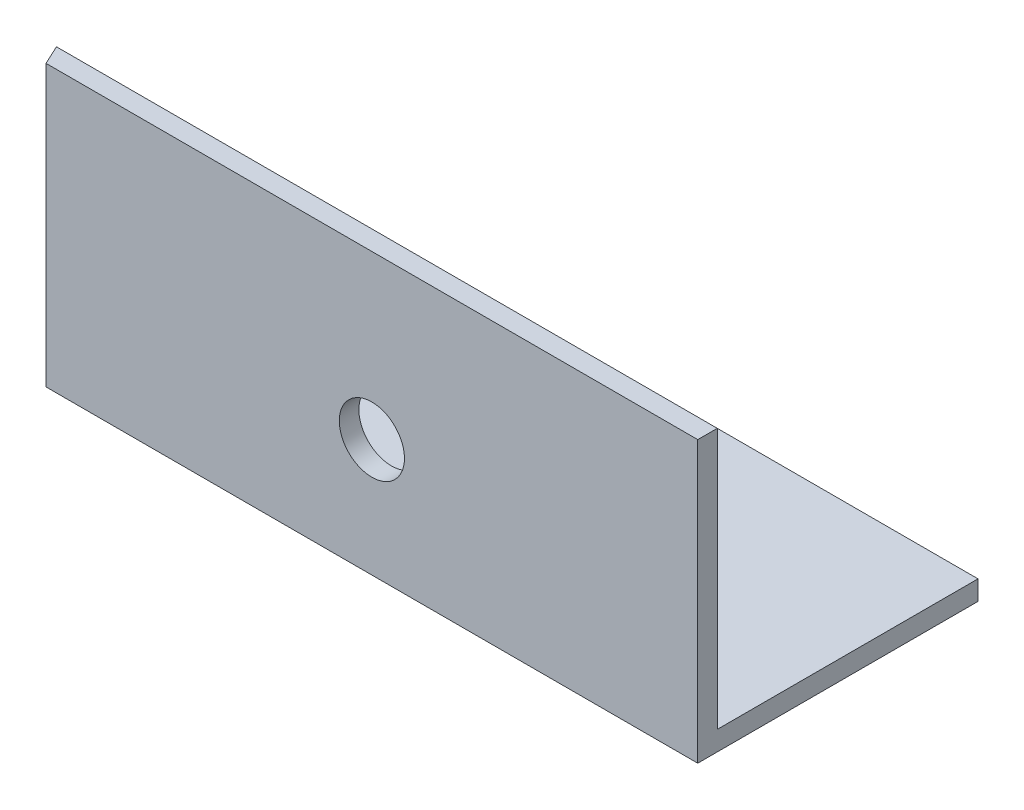
ISO-10303-21;
HEADER;
FILE_DESCRIPTION(('STEP AP214'),'2;1');
FILE_NAME('part.step','',(''),(''),'','','');
FILE_SCHEMA(('AUTOMOTIVE_DESIGN { 1 0 10303 214 1 1 1 1 }'));
ENDSEC;
DATA;
#1=APPLICATION_CONTEXT('core data for automotive mechanical design processes');
#2=APPLICATION_PROTOCOL_DEFINITION('international standard','automotive_design',2000,#1);
#3=PRODUCT_CONTEXT('',#1,'mechanical');
#4=PRODUCT('Part','Part','',(#3));
#5=PRODUCT_RELATED_PRODUCT_CATEGORY('part','',(#4));
#6=PRODUCT_DEFINITION_FORMATION('','',#4);
#7=PRODUCT_DEFINITION_CONTEXT('part definition',#1,'design');
#8=PRODUCT_DEFINITION('design','',#6,#7);
#9=PRODUCT_DEFINITION_SHAPE('','',#8);
#10=(LENGTH_UNIT() NAMED_UNIT(*) SI_UNIT(.MILLI.,.METRE.));
#11=(NAMED_UNIT(*) PLANE_ANGLE_UNIT() SI_UNIT($,.RADIAN.));
#12=(NAMED_UNIT(*) SI_UNIT($,.STERADIAN.) SOLID_ANGLE_UNIT());
#13=UNCERTAINTY_MEASURE_WITH_UNIT(LENGTH_MEASURE(1.E-05),#10,'distance_accuracy_value','');
#14=(GEOMETRIC_REPRESENTATION_CONTEXT(3) GLOBAL_UNCERTAINTY_ASSIGNED_CONTEXT((#13)) GLOBAL_UNIT_ASSIGNED_CONTEXT((#10,
#11,#12)) REPRESENTATION_CONTEXT('',''));
#15=CARTESIAN_POINT('',(0.,0.,0.));
#16=DIRECTION('',(0.,0.,1.));
#17=DIRECTION('',(1.,0.,0.));
#18=AXIS2_PLACEMENT_3D('',#15,#16,#17);
#19=CARTESIAN_POINT('',(120.,-3.,0.));
#20=DIRECTION('',(0.,1.,0.));
#21=DIRECTION('',(0.,0.,1.));
#22=AXIS2_PLACEMENT_3D('',#19,#20,#21);
#23=PLANE('',#22);
#24=DIRECTION('',(-0.421730749715584,0.,-0.906721111888507));
#25=VECTOR('',#24,1.);
#26=CARTESIAN_POINT('',(0.,-3.,-40.));
#27=LINE('',#26,#25);
#28=CARTESIAN_POINT('',(20.,-3.,3.00000000000001));
#29=VERTEX_POINT('',#28);
#30=CARTESIAN_POINT('',(0.,-3.,-40.));
#31=VERTEX_POINT('',#30);
#32=EDGE_CURVE('E79',#29,#31,#27,.T.);
#33=ORIENTED_EDGE('',*,*,#32,.T.);
#34=DIRECTION('',(-1.,0.,0.));
#35=VECTOR('',#34,1.);
#36=CARTESIAN_POINT('',(120.,-3.,-40.));
#37=LINE('',#36,#35);
#38=CARTESIAN_POINT('',(120.,-3.,-40.));
#39=VERTEX_POINT('',#38);
#40=EDGE_CURVE('E11',#39,#31,#37,.T.);
#41=ORIENTED_EDGE('',*,*,#40,.F.);
#42=DIRECTION('',(0.,0.,-1.));
#43=VECTOR('',#42,1.);
#44=CARTESIAN_POINT('',(120.,-3.,0.));
#45=LINE('',#44,#43);
#46=CARTESIAN_POINT('',(120.,-3.,3.00000000000001));
#47=VERTEX_POINT('',#46);
#48=EDGE_CURVE('E100',#47,#39,#45,.T.);
#49=ORIENTED_EDGE('',*,*,#48,.F.);
#50=DIRECTION('',(-1.,0.,0.));
#51=VECTOR('',#50,1.);
#52=CARTESIAN_POINT('',(120.,-3.,3.00000000000001));
#53=LINE('',#52,#51);
#54=EDGE_CURVE('E95',#47,#29,#53,.T.);
#55=ORIENTED_EDGE('',*,*,#54,.T.);
#56=EDGE_LOOP('',(#33,#41,#49,#55));
#57=FACE_BOUND('',#56,.T.);
#58=ADVANCED_FACE('F32',(#57),#23,.F.);
#59=CARTESIAN_POINT('',(120.,0.,0.));
#60=DIRECTION('',(0.,1.,0.));
#61=DIRECTION('',(0.,0.,1.));
#62=AXIS2_PLACEMENT_3D('',#59,#60,#61);
#63=PLANE('',#62);
#64=DIRECTION('',(-1.,0.,0.));
#65=VECTOR('',#64,1.);
#66=CARTESIAN_POINT('',(120.,0.,-40.));
#67=LINE('',#66,#65);
#68=CARTESIAN_POINT('',(120.,0.,-40.));
#69=VERTEX_POINT('',#68);
#70=CARTESIAN_POINT('',(0.,0.,-40.));
#71=VERTEX_POINT('',#70);
#72=EDGE_CURVE('E40',#69,#71,#67,.T.);
#73=ORIENTED_EDGE('',*,*,#72,.T.);
#74=DIRECTION('',(0.421730749715584,0.,0.906721111888507));
#75=VECTOR('',#74,1.);
#76=CARTESIAN_POINT('',(36.6385060026678,0.,38.7727879057359));
#77=LINE('',#76,#75);
#78=CARTESIAN_POINT('',(18.6046511627907,0.,0.));
#79=VERTEX_POINT('',#78);
#80=EDGE_CURVE('E117',#71,#79,#77,.T.);
#81=ORIENTED_EDGE('',*,*,#80,.T.);
#82=DIRECTION('',(-1.,0.,0.));
#83=VECTOR('',#82,1.);
#84=CARTESIAN_POINT('',(120.,0.,0.));
#85=LINE('',#84,#83);
#86=CARTESIAN_POINT('',(120.,0.,0.));
#87=VERTEX_POINT('',#86);
#88=EDGE_CURVE('E110',#87,#79,#85,.T.);
#89=ORIENTED_EDGE('',*,*,#88,.F.);
#90=DIRECTION('',(0.,0.,-1.));
#91=VECTOR('',#90,1.);
#92=CARTESIAN_POINT('',(120.,0.,0.));
#93=LINE('',#92,#91);
#94=EDGE_CURVE('E119',#87,#69,#93,.T.);
#95=ORIENTED_EDGE('',*,*,#94,.T.);
#96=EDGE_LOOP('',(#73,#81,#89,#95));
#97=FACE_BOUND('',#96,.T.);
#98=ADVANCED_FACE('F116',(#97),#63,.T.);
#99=CARTESIAN_POINT('',(120.,40.,-1.19525527596782E-13));
#100=DIRECTION('',(0.,0.,-1.));
#101=DIRECTION('',(0.,1.,0.));
#102=AXIS2_PLACEMENT_3D('',#99,#100,#101);
#103=PLANE('',#102);
#104=CARTESIAN_POINT('',(70.,15.,0.));
#105=DIRECTION('',(0.,0.,-1.));
#106=DIRECTION('',(0.,1.,0.));
#107=AXIS2_PLACEMENT_3D('',#104,#105,#106);
#108=CIRCLE('',#107,5.);
#109=CARTESIAN_POINT('',(70.,20.,0.));
#110=VERTEX_POINT('',#109);
#111=EDGE_CURVE('E90',#110,#110,#108,.T.);
#112=ORIENTED_EDGE('',*,*,#111,.F.);
#113=EDGE_LOOP('',(#112));
#114=FACE_BOUND('',#113,.T.);
#115=ORIENTED_EDGE('',*,*,#88,.T.);
#116=DIRECTION('',(0.,1.,0.));
#117=VECTOR('',#116,1.);
#118=CARTESIAN_POINT('',(18.6046511627907,39.9999999999999,-1.19525527596781E-13));
#119=LINE('',#118,#117);
#120=CARTESIAN_POINT('',(18.6046511627906,40.,-1.17961196366423E-13));
#121=VERTEX_POINT('',#120);
#122=EDGE_CURVE('E126',#79,#121,#119,.T.);
#123=ORIENTED_EDGE('',*,*,#122,.T.);
#124=DIRECTION('',(-1.,0.,0.));
#125=VECTOR('',#124,1.);
#126=CARTESIAN_POINT('',(120.,40.,-1.19525527596782E-13));
#127=LINE('',#126,#125);
#128=CARTESIAN_POINT('',(120.,40.,-1.19525527596782E-13));
#129=VERTEX_POINT('',#128);
#130=EDGE_CURVE('E102',#129,#121,#127,.T.);
#131=ORIENTED_EDGE('',*,*,#130,.F.);
#132=DIRECTION('',(0.,-1.,0.));
#133=VECTOR('',#132,1.);
#134=CARTESIAN_POINT('',(120.,40.,-1.19525527596782E-13));
#135=LINE('',#134,#133);
#136=EDGE_CURVE('E134',#129,#87,#135,.T.);
#137=ORIENTED_EDGE('',*,*,#136,.T.);
#138=EDGE_LOOP('',(#115,#123,#131,#137));
#139=FACE_BOUND('',#138,.T.);
#140=ADVANCED_FACE('F143',(#114,#139),#103,.T.);
#141=CARTESIAN_POINT('',(120.,40.,2.99999999999988));
#142=DIRECTION('',(0.,1.,0.));
#143=DIRECTION('',(0.,0.,1.));
#144=AXIS2_PLACEMENT_3D('',#141,#142,#143);
#145=PLANE('',#144);
#146=ORIENTED_EDGE('',*,*,#130,.T.);
#147=DIRECTION('',(0.421730749715584,0.,0.906721111888507));
#148=VECTOR('',#147,1.);
#149=CARTESIAN_POINT('',(37.7856825255668,40.0000000000001,41.2392174299687));
#150=LINE('',#149,#148);
#151=CARTESIAN_POINT('',(20.,40.,3.00000000000001));
#152=VERTEX_POINT('',#151);
#153=EDGE_CURVE('E98',#121,#152,#150,.T.);
#154=ORIENTED_EDGE('',*,*,#153,.T.);
#155=DIRECTION('',(-1.,0.,0.));
#156=VECTOR('',#155,1.);
#157=CARTESIAN_POINT('',(120.,40.,2.99999999999988));
#158=LINE('',#157,#156);
#159=CARTESIAN_POINT('',(120.,40.,2.99999999999988));
#160=VERTEX_POINT('',#159);
#161=EDGE_CURVE('E97',#160,#152,#158,.T.);
#162=ORIENTED_EDGE('',*,*,#161,.F.);
#163=DIRECTION('',(0.,0.,-1.));
#164=VECTOR('',#163,1.);
#165=CARTESIAN_POINT('',(120.,40.,2.99999999999988));
#166=LINE('',#165,#164);
#167=EDGE_CURVE('E104',#160,#129,#166,.T.);
#168=ORIENTED_EDGE('',*,*,#167,.T.);
#169=EDGE_LOOP('',(#146,#154,#162,#168));
#170=FACE_BOUND('',#169,.T.);
#171=ADVANCED_FACE('F139',(#170),#145,.T.);
#172=CARTESIAN_POINT('',(120.,40.,2.99999999999988));
#173=DIRECTION('',(0.,0.,-1.));
#174=DIRECTION('',(0.,1.,0.));
#175=AXIS2_PLACEMENT_3D('',#172,#173,#174);
#176=PLANE('',#175);
#177=CARTESIAN_POINT('',(70.,15.,3.));
#178=DIRECTION('',(0.,0.,1.));
#179=DIRECTION('',(1.,0.,0.));
#180=AXIS2_PLACEMENT_3D('',#177,#178,#179);
#181=CIRCLE('',#180,5.);
#182=CARTESIAN_POINT('',(75.,15.,3.));
#183=VERTEX_POINT('',#182);
#184=EDGE_CURVE('E147',#183,#183,#181,.T.);
#185=ORIENTED_EDGE('',*,*,#184,.F.);
#186=EDGE_LOOP('',(#185));
#187=FACE_BOUND('',#186,.T.);
#188=DIRECTION('',(0.,-1.,0.));
#189=VECTOR('',#188,1.);
#190=CARTESIAN_POINT('',(20.,47.,3.00000000000001));
#191=LINE('',#190,#189);
#192=EDGE_CURVE('E82',#152,#29,#191,.T.);
#193=ORIENTED_EDGE('',*,*,#192,.T.);
#194=ORIENTED_EDGE('',*,*,#54,.F.);
#195=DIRECTION('',(0.,-1.,0.));
#196=VECTOR('',#195,1.);
#197=CARTESIAN_POINT('',(120.,40.,2.99999999999988));
#198=LINE('',#197,#196);
#199=EDGE_CURVE('E47',#160,#47,#198,.T.);
#200=ORIENTED_EDGE('',*,*,#199,.F.);
#201=ORIENTED_EDGE('',*,*,#161,.T.);
#202=EDGE_LOOP('',(#193,#194,#200,#201));
#203=FACE_BOUND('',#202,.T.);
#204=ADVANCED_FACE('F94',(#187,#203),#176,.F.);
#205=CARTESIAN_POINT('',(120.,0.,-40.));
#206=DIRECTION('',(0.,0.,-1.));
#207=DIRECTION('',(-1.,0.,0.));
#208=AXIS2_PLACEMENT_3D('',#205,#206,#207);
#209=PLANE('',#208);
#210=DIRECTION('',(0.,-1.,0.));
#211=VECTOR('',#210,1.);
#212=CARTESIAN_POINT('',(0.,0.,-40.));
#213=LINE('',#212,#211);
#214=EDGE_CURVE('E86',#71,#31,#213,.T.);
#215=ORIENTED_EDGE('',*,*,#214,.F.);
#216=ORIENTED_EDGE('',*,*,#72,.F.);
#217=DIRECTION('',(0.,-1.,0.));
#218=VECTOR('',#217,1.);
#219=CARTESIAN_POINT('',(120.,0.,-40.));
#220=LINE('',#219,#218);
#221=EDGE_CURVE('E124',#69,#39,#220,.T.);
#222=ORIENTED_EDGE('',*,*,#221,.T.);
#223=ORIENTED_EDGE('',*,*,#40,.T.);
#224=EDGE_LOOP('',(#215,#216,#222,#223));
#225=FACE_BOUND('',#224,.T.);
#226=ADVANCED_FACE('F123',(#225),#209,.T.);
#227=CARTESIAN_POINT('',(120.,0.,0.));
#228=DIRECTION('',(-1.,0.,0.));
#229=DIRECTION('',(0.,0.,1.));
#230=AXIS2_PLACEMENT_3D('',#227,#228,#229);
#231=PLANE('',#230);
#232=ORIENTED_EDGE('',*,*,#48,.T.);
#233=ORIENTED_EDGE('',*,*,#221,.F.);
#234=ORIENTED_EDGE('',*,*,#94,.F.);
#235=ORIENTED_EDGE('',*,*,#136,.F.);
#236=ORIENTED_EDGE('',*,*,#167,.F.);
#237=ORIENTED_EDGE('',*,*,#199,.T.);
#238=EDGE_LOOP('',(#232,#233,#234,#235,#236,#237));
#239=FACE_BOUND('',#238,.T.);
#240=ADVANCED_FACE('F141',(#239),#231,.F.);
#241=CARTESIAN_POINT('',(0.,47.,-40.));
#242=DIRECTION('',(-0.906721111888507,0.,0.421730749715584));
#243=DIRECTION('',(0.421730749715584,0.,0.906721111888507));
#244=AXIS2_PLACEMENT_3D('',#241,#242,#243);
#245=PLANE('',#244);
#246=ORIENTED_EDGE('',*,*,#214,.T.);
#247=ORIENTED_EDGE('',*,*,#32,.F.);
#248=ORIENTED_EDGE('',*,*,#192,.F.);
#249=ORIENTED_EDGE('',*,*,#153,.F.);
#250=ORIENTED_EDGE('',*,*,#122,.F.);
#251=ORIENTED_EDGE('',*,*,#80,.F.);
#252=EDGE_LOOP('',(#246,#247,#248,#249,#250,#251));
#253=FACE_BOUND('',#252,.T.);
#254=ADVANCED_FACE('F81',(#253),#245,.T.);
#255=CARTESIAN_POINT('',(70.,15.,-7.));
#256=DIRECTION('',(0.,0.,1.));
#257=DIRECTION('',(1.,0.,0.));
#258=AXIS2_PLACEMENT_3D('',#255,#256,#257);
#259=CYLINDRICAL_SURFACE('',#258,5.);
#260=ORIENTED_EDGE('',*,*,#111,.T.);
#261=EDGE_LOOP('',(#260));
#262=FACE_BOUND('',#261,.T.);
#263=ORIENTED_EDGE('',*,*,#184,.T.);
#264=EDGE_LOOP('',(#263));
#265=FACE_BOUND('',#264,.T.);
#266=ADVANCED_FACE('F151',(#262,#265),#259,.F.);
#267=CLOSED_SHELL('',(#58,#98,#140,#171,#204,#226,#240,#254,#266));
#268=MANIFOLD_SOLID_BREP('B2',#267);
#269=ADVANCED_BREP_SHAPE_REPRESENTATION('',(#18,#268),#14);
#270=SHAPE_DEFINITION_REPRESENTATION(#9,#269);
ENDSEC;
END-ISO-10303-21;
